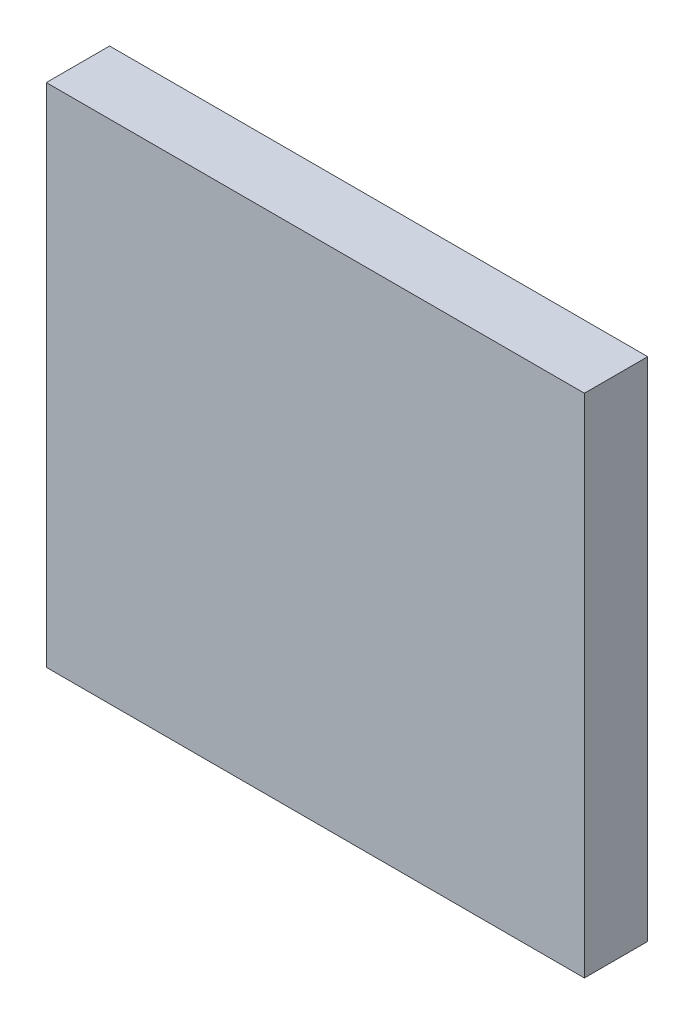
ISO-10303-21;
HEADER;
FILE_DESCRIPTION(('STEP AP214'),'2;1');
FILE_NAME('part.step','',(''),(''),'','','');
FILE_SCHEMA(('AUTOMOTIVE_DESIGN { 1 0 10303 214 1 1 1 1 }'));
ENDSEC;
DATA;
#1=APPLICATION_CONTEXT('core data for automotive mechanical design processes');
#2=APPLICATION_PROTOCOL_DEFINITION('international standard','automotive_design',2000,#1);
#3=PRODUCT_CONTEXT('',#1,'mechanical');
#4=PRODUCT('Part','Part','',(#3));
#5=PRODUCT_RELATED_PRODUCT_CATEGORY('part','',(#4));
#6=PRODUCT_DEFINITION_FORMATION('','',#4);
#7=PRODUCT_DEFINITION_CONTEXT('part definition',#1,'design');
#8=PRODUCT_DEFINITION('design','',#6,#7);
#9=PRODUCT_DEFINITION_SHAPE('','',#8);
#10=(LENGTH_UNIT() NAMED_UNIT(*) SI_UNIT(.MILLI.,.METRE.));
#11=(NAMED_UNIT(*) PLANE_ANGLE_UNIT() SI_UNIT($,.RADIAN.));
#12=(NAMED_UNIT(*) SI_UNIT($,.STERADIAN.) SOLID_ANGLE_UNIT());
#13=UNCERTAINTY_MEASURE_WITH_UNIT(LENGTH_MEASURE(1.E-05),#10,'distance_accuracy_value','');
#14=(GEOMETRIC_REPRESENTATION_CONTEXT(3) GLOBAL_UNCERTAINTY_ASSIGNED_CONTEXT((#13)) GLOBAL_UNIT_ASSIGNED_CONTEXT((#10,
#11,#12)) REPRESENTATION_CONTEXT('',''));
#15=CARTESIAN_POINT('',(0.,0.,0.));
#16=DIRECTION('',(0.,0.,1.));
#17=DIRECTION('',(1.,0.,0.));
#18=AXIS2_PLACEMENT_3D('',#15,#16,#17);
#19=CARTESIAN_POINT('',(0.,-400.800000000001,-50.8));
#20=DIRECTION('',(-1.,0.,0.));
#21=DIRECTION('',(0.,0.,1.));
#22=AXIS2_PLACEMENT_3D('',#19,#20,#21);
#23=PLANE('',#22);
#24=DIRECTION('',(0.,-1.,0.));
#25=VECTOR('',#24,1.);
#26=CARTESIAN_POINT('',(0.,-400.800000000001,0.));
#27=LINE('',#26,#25);
#28=CARTESIAN_POINT('',(0.,5.59999999999899,0.));
#29=VERTEX_POINT('',#28);
#30=CARTESIAN_POINT('',(0.,-400.800000000001,0.));
#31=VERTEX_POINT('',#30);
#32=EDGE_CURVE('E109',#29,#31,#27,.T.);
#33=ORIENTED_EDGE('',*,*,#32,.F.);
#34=DIRECTION('',(0.,0.,1.));
#35=VECTOR('',#34,1.);
#36=CARTESIAN_POINT('',(0.,5.59999999999899,-50.8));
#37=LINE('',#36,#35);
#38=CARTESIAN_POINT('',(0.,5.59999999999899,-50.8));
#39=VERTEX_POINT('',#38);
#40=EDGE_CURVE('E11',#39,#29,#37,.T.);
#41=ORIENTED_EDGE('',*,*,#40,.F.);
#42=DIRECTION('',(0.,-1.,0.));
#43=VECTOR('',#42,1.);
#44=CARTESIAN_POINT('',(0.,-400.800000000001,-50.8));
#45=LINE('',#44,#43);
#46=CARTESIAN_POINT('',(0.,-400.800000000001,-50.8));
#47=VERTEX_POINT('',#46);
#48=EDGE_CURVE('E101',#39,#47,#45,.T.);
#49=ORIENTED_EDGE('',*,*,#48,.T.);
#50=DIRECTION('',(0.,0.,1.));
#51=VECTOR('',#50,1.);
#52=CARTESIAN_POINT('',(0.,-400.800000000001,-50.8));
#53=LINE('',#52,#51);
#54=EDGE_CURVE('E42',#47,#31,#53,.T.);
#55=ORIENTED_EDGE('',*,*,#54,.T.);
#56=EDGE_LOOP('',(#33,#41,#49,#55));
#57=FACE_BOUND('',#56,.T.);
#58=ADVANCED_FACE('F39',(#57),#23,.T.);
#59=CARTESIAN_POINT('',(0.,5.59999999999899,-50.8));
#60=DIRECTION('',(0.,1.,0.));
#61=DIRECTION('',(0.,0.,1.));
#62=AXIS2_PLACEMENT_3D('',#59,#60,#61);
#63=PLANE('',#62);
#64=DIRECTION('',(-1.,0.,0.));
#65=VECTOR('',#64,1.);
#66=CARTESIAN_POINT('',(0.,5.59999999999899,0.));
#67=LINE('',#66,#65);
#68=CARTESIAN_POINT('',(431.8,5.59999999999899,0.));
#69=VERTEX_POINT('',#68);
#70=EDGE_CURVE('E104',#69,#29,#67,.T.);
#71=ORIENTED_EDGE('',*,*,#70,.F.);
#72=DIRECTION('',(0.,0.,1.));
#73=VECTOR('',#72,1.);
#74=CARTESIAN_POINT('',(431.8,5.59999999999899,-50.8));
#75=LINE('',#74,#73);
#76=CARTESIAN_POINT('',(431.8,5.59999999999899,-50.8));
#77=VERTEX_POINT('',#76);
#78=EDGE_CURVE('E49',#77,#69,#75,.T.);
#79=ORIENTED_EDGE('',*,*,#78,.F.);
#80=DIRECTION('',(-1.,0.,0.));
#81=VECTOR('',#80,1.);
#82=CARTESIAN_POINT('',(0.,5.59999999999899,-50.8));
#83=LINE('',#82,#81);
#84=EDGE_CURVE('E96',#77,#39,#83,.T.);
#85=ORIENTED_EDGE('',*,*,#84,.T.);
#86=ORIENTED_EDGE('',*,*,#40,.T.);
#87=EDGE_LOOP('',(#71,#79,#85,#86));
#88=FACE_BOUND('',#87,.T.);
#89=ADVANCED_FACE('F125',(#88),#63,.T.);
#90=CARTESIAN_POINT('',(431.8,-400.800000000001,-50.8));
#91=DIRECTION('',(1.,0.,0.));
#92=DIRECTION('',(0.,1.,0.));
#93=AXIS2_PLACEMENT_3D('',#90,#91,#92);
#94=PLANE('',#93);
#95=DIRECTION('',(0.,1.,0.));
#96=VECTOR('',#95,1.);
#97=CARTESIAN_POINT('',(431.8,-400.800000000001,0.));
#98=LINE('',#97,#96);
#99=CARTESIAN_POINT('',(431.8,-400.800000000001,0.));
#100=VERTEX_POINT('',#99);
#101=EDGE_CURVE('E90',#100,#69,#98,.T.);
#102=ORIENTED_EDGE('',*,*,#101,.F.);
#103=DIRECTION('',(0.,0.,1.));
#104=VECTOR('',#103,1.);
#105=CARTESIAN_POINT('',(431.8,-400.800000000001,-50.8));
#106=LINE('',#105,#104);
#107=CARTESIAN_POINT('',(431.8,-400.800000000001,-50.8));
#108=VERTEX_POINT('',#107);
#109=EDGE_CURVE('E85',#108,#100,#106,.T.);
#110=ORIENTED_EDGE('',*,*,#109,.F.);
#111=DIRECTION('',(0.,1.,0.));
#112=VECTOR('',#111,1.);
#113=CARTESIAN_POINT('',(431.8,-400.800000000001,-50.8));
#114=LINE('',#113,#112);
#115=EDGE_CURVE('E88',#108,#77,#114,.T.);
#116=ORIENTED_EDGE('',*,*,#115,.T.);
#117=ORIENTED_EDGE('',*,*,#78,.T.);
#118=EDGE_LOOP('',(#102,#110,#116,#117));
#119=FACE_BOUND('',#118,.T.);
#120=ADVANCED_FACE('F87',(#119),#94,.T.);
#121=CARTESIAN_POINT('',(0.,-400.800000000001,-50.8));
#122=DIRECTION('',(0.,-1.,0.));
#123=DIRECTION('',(0.,0.,-1.));
#124=AXIS2_PLACEMENT_3D('',#121,#122,#123);
#125=PLANE('',#124);
#126=DIRECTION('',(1.,0.,0.));
#127=VECTOR('',#126,1.);
#128=CARTESIAN_POINT('',(0.,-400.800000000001,0.));
#129=LINE('',#128,#127);
#130=EDGE_CURVE('E113',#31,#100,#129,.T.);
#131=ORIENTED_EDGE('',*,*,#130,.F.);
#132=ORIENTED_EDGE('',*,*,#54,.F.);
#133=DIRECTION('',(1.,0.,0.));
#134=VECTOR('',#133,1.);
#135=CARTESIAN_POINT('',(0.,-400.800000000001,-50.8));
#136=LINE('',#135,#134);
#137=EDGE_CURVE('E95',#47,#108,#136,.T.);
#138=ORIENTED_EDGE('',*,*,#137,.T.);
#139=ORIENTED_EDGE('',*,*,#109,.T.);
#140=EDGE_LOOP('',(#131,#132,#138,#139));
#141=FACE_BOUND('',#140,.T.);
#142=ADVANCED_FACE('F99',(#141),#125,.T.);
#143=CARTESIAN_POINT('',(0.,0.,-50.8));
#144=DIRECTION('',(0.,0.,-1.));
#145=DIRECTION('',(-1.,0.,0.));
#146=AXIS2_PLACEMENT_3D('',#143,#144,#145);
#147=PLANE('',#146);
#148=ORIENTED_EDGE('',*,*,#48,.F.);
#149=ORIENTED_EDGE('',*,*,#84,.F.);
#150=ORIENTED_EDGE('',*,*,#115,.F.);
#151=ORIENTED_EDGE('',*,*,#137,.F.);
#152=EDGE_LOOP('',(#148,#149,#150,#151));
#153=FACE_BOUND('',#152,.T.);
#154=ADVANCED_FACE('F94',(#153),#147,.T.);
#155=CARTESIAN_POINT('',(0.,0.,0.));
#156=DIRECTION('',(0.,0.,-1.));
#157=DIRECTION('',(-1.,0.,0.));
#158=AXIS2_PLACEMENT_3D('',#155,#156,#157);
#159=PLANE('',#158);
#160=ORIENTED_EDGE('',*,*,#32,.T.);
#161=ORIENTED_EDGE('',*,*,#130,.T.);
#162=ORIENTED_EDGE('',*,*,#101,.T.);
#163=ORIENTED_EDGE('',*,*,#70,.T.);
#164=EDGE_LOOP('',(#160,#161,#162,#163));
#165=FACE_BOUND('',#164,.T.);
#166=ADVANCED_FACE('F124',(#165),#159,.F.);
#167=CLOSED_SHELL('',(#58,#89,#120,#142,#154,#166));
#168=MANIFOLD_SOLID_BREP('B2',#167);
#169=ADVANCED_BREP_SHAPE_REPRESENTATION('',(#18,#168),#14);
#170=SHAPE_DEFINITION_REPRESENTATION(#9,#169);
ENDSEC;
END-ISO-10303-21;
